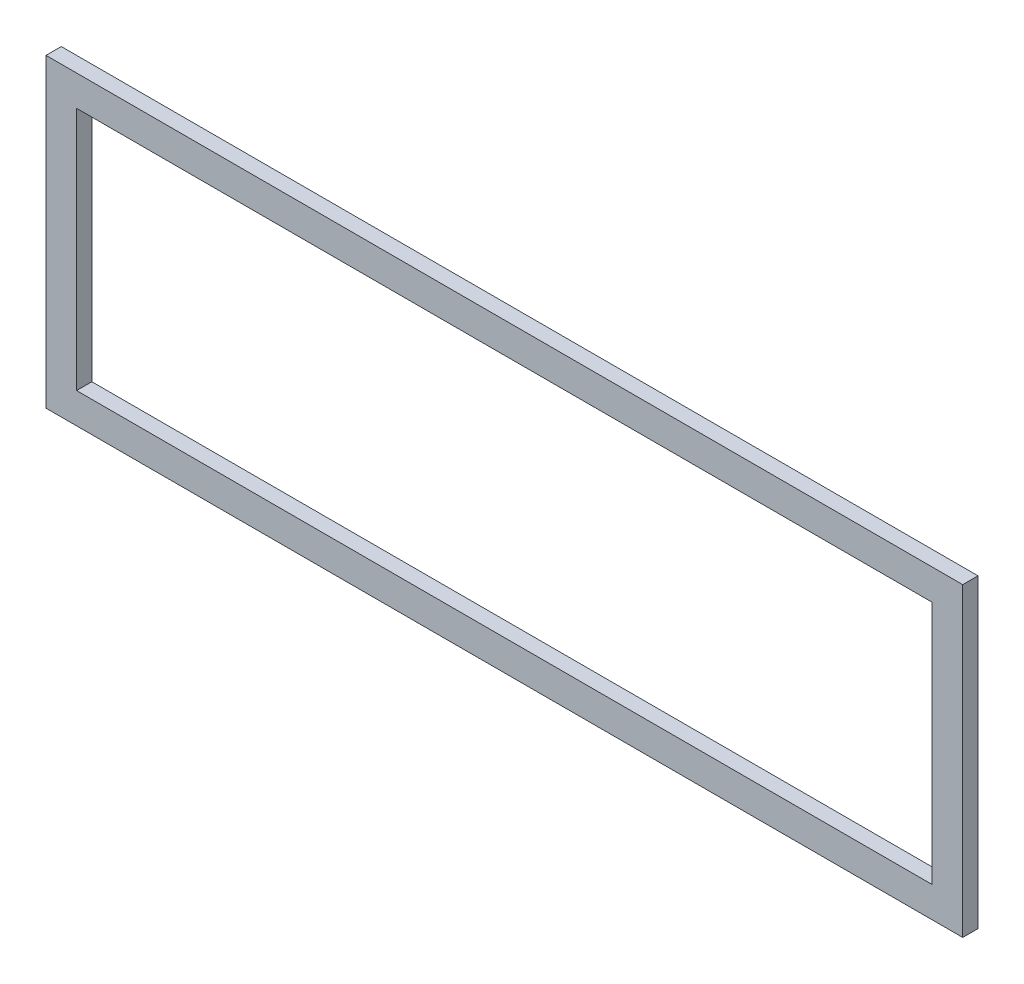
ISO-10303-21;
HEADER;
FILE_DESCRIPTION(('STEP AP214'),'2;1');
FILE_NAME('part.step','',(''),(''),'','','');
FILE_SCHEMA(('AUTOMOTIVE_DESIGN { 1 0 10303 214 1 1 1 1 }'));
ENDSEC;
DATA;
#1=APPLICATION_CONTEXT('core data for automotive mechanical design processes');
#2=APPLICATION_PROTOCOL_DEFINITION('international standard','automotive_design',2000,#1);
#3=PRODUCT_CONTEXT('',#1,'mechanical');
#4=PRODUCT('Part','Part','',(#3));
#5=PRODUCT_RELATED_PRODUCT_CATEGORY('part','',(#4));
#6=PRODUCT_DEFINITION_FORMATION('','',#4);
#7=PRODUCT_DEFINITION_CONTEXT('part definition',#1,'design');
#8=PRODUCT_DEFINITION('design','',#6,#7);
#9=PRODUCT_DEFINITION_SHAPE('','',#8);
#10=(LENGTH_UNIT() NAMED_UNIT(*) SI_UNIT(.MILLI.,.METRE.));
#11=(NAMED_UNIT(*) PLANE_ANGLE_UNIT() SI_UNIT($,.RADIAN.));
#12=(NAMED_UNIT(*) SI_UNIT($,.STERADIAN.) SOLID_ANGLE_UNIT());
#13=UNCERTAINTY_MEASURE_WITH_UNIT(LENGTH_MEASURE(1.E-05),#10,'distance_accuracy_value','');
#14=(GEOMETRIC_REPRESENTATION_CONTEXT(3) GLOBAL_UNCERTAINTY_ASSIGNED_CONTEXT((#13)) GLOBAL_UNIT_ASSIGNED_CONTEXT((#10,
#11,#12)) REPRESENTATION_CONTEXT('',''));
#15=CARTESIAN_POINT('',(0.,0.,0.));
#16=DIRECTION('',(0.,0.,1.));
#17=DIRECTION('',(1.,0.,0.));
#18=AXIS2_PLACEMENT_3D('',#15,#16,#17);
#19=CARTESIAN_POINT('',(0.,0.,2.5));
#20=DIRECTION('',(0.,0.,-1.));
#21=DIRECTION('',(-1.,0.,0.));
#22=AXIS2_PLACEMENT_3D('',#19,#20,#21);
#23=PLANE('',#22);
#24=DIRECTION('',(0.,1.,0.));
#25=VECTOR('',#24,1.);
#26=CARTESIAN_POINT('',(150.,-50.,2.5));
#27=LINE('',#26,#25);
#28=CARTESIAN_POINT('',(150.,-50.,2.5));
#29=VERTEX_POINT('',#28);
#30=CARTESIAN_POINT('',(150.,50.,2.5));
#31=VERTEX_POINT('',#30);
#32=EDGE_CURVE('E134',#29,#31,#27,.T.);
#33=ORIENTED_EDGE('',*,*,#32,.T.);
#34=DIRECTION('',(-1.,0.,0.));
#35=VECTOR('',#34,1.);
#36=CARTESIAN_POINT('',(-150.,50.,2.5));
#37=LINE('',#36,#35);
#38=CARTESIAN_POINT('',(-150.,50.,2.5));
#39=VERTEX_POINT('',#38);
#40=EDGE_CURVE('E137',#31,#39,#37,.T.);
#41=ORIENTED_EDGE('',*,*,#40,.T.);
#42=DIRECTION('',(0.,-1.,0.));
#43=VECTOR('',#42,1.);
#44=CARTESIAN_POINT('',(-150.,-50.,2.5));
#45=LINE('',#44,#43);
#46=CARTESIAN_POINT('',(-150.,-50.,2.5));
#47=VERTEX_POINT('',#46);
#48=EDGE_CURVE('E140',#39,#47,#45,.T.);
#49=ORIENTED_EDGE('',*,*,#48,.T.);
#50=DIRECTION('',(1.,0.,0.));
#51=VECTOR('',#50,1.);
#52=CARTESIAN_POINT('',(-150.,-50.,2.5));
#53=LINE('',#52,#51);
#54=EDGE_CURVE('E142',#47,#29,#53,.T.);
#55=ORIENTED_EDGE('',*,*,#54,.T.);
#56=EDGE_LOOP('',(#33,#41,#49,#55));
#57=FACE_BOUND('',#56,.T.);
#58=DIRECTION('',(0.,1.,0.));
#59=VECTOR('',#58,1.);
#60=CARTESIAN_POINT('',(140.,-40.,2.5));
#61=LINE('',#60,#59);
#62=CARTESIAN_POINT('',(140.,-40.,2.5));
#63=VERTEX_POINT('',#62);
#64=CARTESIAN_POINT('',(140.,40.,2.5));
#65=VERTEX_POINT('',#64);
#66=EDGE_CURVE('E98',#63,#65,#61,.T.);
#67=ORIENTED_EDGE('',*,*,#66,.F.);
#68=DIRECTION('',(1.,0.,0.));
#69=VECTOR('',#68,1.);
#70=CARTESIAN_POINT('',(-140.,-40.,2.5));
#71=LINE('',#70,#69);
#72=CARTESIAN_POINT('',(-140.,-40.,2.5));
#73=VERTEX_POINT('',#72);
#74=EDGE_CURVE('E120',#73,#63,#71,.T.);
#75=ORIENTED_EDGE('',*,*,#74,.F.);
#76=DIRECTION('',(0.,-1.,0.));
#77=VECTOR('',#76,1.);
#78=CARTESIAN_POINT('',(-140.,-40.,2.5));
#79=LINE('',#78,#77);
#80=CARTESIAN_POINT('',(-140.,40.,2.5));
#81=VERTEX_POINT('',#80);
#82=EDGE_CURVE('E118',#81,#73,#79,.T.);
#83=ORIENTED_EDGE('',*,*,#82,.F.);
#84=DIRECTION('',(-1.,0.,0.));
#85=VECTOR('',#84,1.);
#86=CARTESIAN_POINT('',(-140.,40.,2.5));
#87=LINE('',#86,#85);
#88=EDGE_CURVE('E106',#65,#81,#87,.T.);
#89=ORIENTED_EDGE('',*,*,#88,.F.);
#90=EDGE_LOOP('',(#67,#75,#83,#89));
#91=FACE_BOUND('',#90,.T.);
#92=ADVANCED_FACE('F33',(#57,#91),#23,.F.);
#93=CARTESIAN_POINT('',(0.,0.,-2.5));
#94=DIRECTION('',(0.,0.,-1.));
#95=DIRECTION('',(-1.,0.,0.));
#96=AXIS2_PLACEMENT_3D('',#93,#94,#95);
#97=PLANE('',#96);
#98=DIRECTION('',(0.,1.,0.));
#99=VECTOR('',#98,1.);
#100=CARTESIAN_POINT('',(150.,-50.,-2.5));
#101=LINE('',#100,#99);
#102=CARTESIAN_POINT('',(150.,-50.,-2.5));
#103=VERTEX_POINT('',#102);
#104=CARTESIAN_POINT('',(150.,50.,-2.5));
#105=VERTEX_POINT('',#104);
#106=EDGE_CURVE('E114',#103,#105,#101,.T.);
#107=ORIENTED_EDGE('',*,*,#106,.F.);
#108=DIRECTION('',(1.,0.,0.));
#109=VECTOR('',#108,1.);
#110=CARTESIAN_POINT('',(-150.,-50.,-2.5));
#111=LINE('',#110,#109);
#112=CARTESIAN_POINT('',(-150.,-50.,-2.5));
#113=VERTEX_POINT('',#112);
#114=EDGE_CURVE('E138',#113,#103,#111,.T.);
#115=ORIENTED_EDGE('',*,*,#114,.F.);
#116=DIRECTION('',(0.,-1.,0.));
#117=VECTOR('',#116,1.);
#118=CARTESIAN_POINT('',(-150.,-50.,-2.5));
#119=LINE('',#118,#117);
#120=CARTESIAN_POINT('',(-150.,50.,-2.5));
#121=VERTEX_POINT('',#120);
#122=EDGE_CURVE('E149',#121,#113,#119,.T.);
#123=ORIENTED_EDGE('',*,*,#122,.F.);
#124=DIRECTION('',(-1.,0.,0.));
#125=VECTOR('',#124,1.);
#126=CARTESIAN_POINT('',(-150.,50.,-2.5));
#127=LINE('',#126,#125);
#128=EDGE_CURVE('E147',#105,#121,#127,.T.);
#129=ORIENTED_EDGE('',*,*,#128,.F.);
#130=EDGE_LOOP('',(#107,#115,#123,#129));
#131=FACE_BOUND('',#130,.T.);
#132=DIRECTION('',(1.,0.,0.));
#133=VECTOR('',#132,1.);
#134=CARTESIAN_POINT('',(-140.,-40.,-2.5));
#135=LINE('',#134,#133);
#136=CARTESIAN_POINT('',(-140.,-40.,-2.5));
#137=VERTEX_POINT('',#136);
#138=CARTESIAN_POINT('',(140.,-40.,-2.5));
#139=VERTEX_POINT('',#138);
#140=EDGE_CURVE('E107',#137,#139,#135,.T.);
#141=ORIENTED_EDGE('',*,*,#140,.T.);
#142=DIRECTION('',(0.,1.,0.));
#143=VECTOR('',#142,1.);
#144=CARTESIAN_POINT('',(140.,-40.,-2.5));
#145=LINE('',#144,#143);
#146=CARTESIAN_POINT('',(140.,40.,-2.5));
#147=VERTEX_POINT('',#146);
#148=EDGE_CURVE('E56',#139,#147,#145,.T.);
#149=ORIENTED_EDGE('',*,*,#148,.T.);
#150=DIRECTION('',(-1.,0.,0.));
#151=VECTOR('',#150,1.);
#152=CARTESIAN_POINT('',(-140.,40.,-2.5));
#153=LINE('',#152,#151);
#154=CARTESIAN_POINT('',(-140.,40.,-2.5));
#155=VERTEX_POINT('',#154);
#156=EDGE_CURVE('E113',#147,#155,#153,.T.);
#157=ORIENTED_EDGE('',*,*,#156,.T.);
#158=DIRECTION('',(0.,-1.,0.));
#159=VECTOR('',#158,1.);
#160=CARTESIAN_POINT('',(-140.,-40.,-2.5));
#161=LINE('',#160,#159);
#162=EDGE_CURVE('E126',#155,#137,#161,.T.);
#163=ORIENTED_EDGE('',*,*,#162,.T.);
#164=EDGE_LOOP('',(#141,#149,#157,#163));
#165=FACE_BOUND('',#164,.T.);
#166=ADVANCED_FACE('F167',(#131,#165),#97,.T.);
#167=CARTESIAN_POINT('',(150.,-50.,2.5));
#168=DIRECTION('',(-1.,0.,0.));
#169=DIRECTION('',(0.,0.,1.));
#170=AXIS2_PLACEMENT_3D('',#167,#168,#169);
#171=PLANE('',#170);
#172=ORIENTED_EDGE('',*,*,#106,.T.);
#173=DIRECTION('',(0.,0.,-1.));
#174=VECTOR('',#173,1.);
#175=CARTESIAN_POINT('',(150.,50.,2.5));
#176=LINE('',#175,#174);
#177=EDGE_CURVE('E11',#31,#105,#176,.T.);
#178=ORIENTED_EDGE('',*,*,#177,.F.);
#179=ORIENTED_EDGE('',*,*,#32,.F.);
#180=DIRECTION('',(0.,0.,-1.));
#181=VECTOR('',#180,1.);
#182=CARTESIAN_POINT('',(150.,-50.,2.5));
#183=LINE('',#182,#181);
#184=EDGE_CURVE('E144',#29,#103,#183,.T.);
#185=ORIENTED_EDGE('',*,*,#184,.T.);
#186=EDGE_LOOP('',(#172,#178,#179,#185));
#187=FACE_BOUND('',#186,.T.);
#188=ADVANCED_FACE('F35',(#187),#171,.F.);
#189=CARTESIAN_POINT('',(-150.,50.,2.5));
#190=DIRECTION('',(0.,-1.,0.));
#191=DIRECTION('',(1.,0.,0.));
#192=AXIS2_PLACEMENT_3D('',#189,#190,#191);
#193=PLANE('',#192);
#194=ORIENTED_EDGE('',*,*,#128,.T.);
#195=DIRECTION('',(0.,0.,-1.));
#196=VECTOR('',#195,1.);
#197=CARTESIAN_POINT('',(-150.,50.,2.5));
#198=LINE('',#197,#196);
#199=EDGE_CURVE('E41',#39,#121,#198,.T.);
#200=ORIENTED_EDGE('',*,*,#199,.F.);
#201=ORIENTED_EDGE('',*,*,#40,.F.);
#202=ORIENTED_EDGE('',*,*,#177,.T.);
#203=EDGE_LOOP('',(#194,#200,#201,#202));
#204=FACE_BOUND('',#203,.T.);
#205=ADVANCED_FACE('F177',(#204),#193,.F.);
#206=CARTESIAN_POINT('',(-150.,-50.,2.5));
#207=DIRECTION('',(1.,0.,0.));
#208=DIRECTION('',(0.,0.,-1.));
#209=AXIS2_PLACEMENT_3D('',#206,#207,#208);
#210=PLANE('',#209);
#211=ORIENTED_EDGE('',*,*,#122,.T.);
#212=DIRECTION('',(0.,0.,-1.));
#213=VECTOR('',#212,1.);
#214=CARTESIAN_POINT('',(-150.,-50.,2.5));
#215=LINE('',#214,#213);
#216=EDGE_CURVE('E154',#47,#113,#215,.T.);
#217=ORIENTED_EDGE('',*,*,#216,.F.);
#218=ORIENTED_EDGE('',*,*,#48,.F.);
#219=ORIENTED_EDGE('',*,*,#199,.T.);
#220=EDGE_LOOP('',(#211,#217,#218,#219));
#221=FACE_BOUND('',#220,.T.);
#222=ADVANCED_FACE('F161',(#221),#210,.F.);
#223=CARTESIAN_POINT('',(-150.,-50.,2.5));
#224=DIRECTION('',(0.,1.,0.));
#225=DIRECTION('',(0.,0.,1.));
#226=AXIS2_PLACEMENT_3D('',#223,#224,#225);
#227=PLANE('',#226);
#228=ORIENTED_EDGE('',*,*,#114,.T.);
#229=ORIENTED_EDGE('',*,*,#184,.F.);
#230=ORIENTED_EDGE('',*,*,#54,.F.);
#231=ORIENTED_EDGE('',*,*,#216,.T.);
#232=EDGE_LOOP('',(#228,#229,#230,#231));
#233=FACE_BOUND('',#232,.T.);
#234=ADVANCED_FACE('F171',(#233),#227,.F.);
#235=CARTESIAN_POINT('',(140.,-40.,2.5));
#236=DIRECTION('',(-1.,0.,0.));
#237=DIRECTION('',(0.,0.,1.));
#238=AXIS2_PLACEMENT_3D('',#235,#236,#237);
#239=PLANE('',#238);
#240=ORIENTED_EDGE('',*,*,#148,.F.);
#241=DIRECTION('',(0.,0.,-1.));
#242=VECTOR('',#241,1.);
#243=CARTESIAN_POINT('',(140.,-40.,2.5));
#244=LINE('',#243,#242);
#245=EDGE_CURVE('E102',#63,#139,#244,.T.);
#246=ORIENTED_EDGE('',*,*,#245,.F.);
#247=ORIENTED_EDGE('',*,*,#66,.T.);
#248=DIRECTION('',(0.,0.,-1.));
#249=VECTOR('',#248,1.);
#250=CARTESIAN_POINT('',(140.,40.,2.5));
#251=LINE('',#250,#249);
#252=EDGE_CURVE('E101',#65,#147,#251,.T.);
#253=ORIENTED_EDGE('',*,*,#252,.T.);
#254=EDGE_LOOP('',(#240,#246,#247,#253));
#255=FACE_BOUND('',#254,.T.);
#256=ADVANCED_FACE('F100',(#255),#239,.T.);
#257=CARTESIAN_POINT('',(-140.,40.,2.5));
#258=DIRECTION('',(0.,-1.,0.));
#259=DIRECTION('',(0.,0.,-1.));
#260=AXIS2_PLACEMENT_3D('',#257,#258,#259);
#261=PLANE('',#260);
#262=ORIENTED_EDGE('',*,*,#156,.F.);
#263=ORIENTED_EDGE('',*,*,#252,.F.);
#264=ORIENTED_EDGE('',*,*,#88,.T.);
#265=DIRECTION('',(0.,0.,-1.));
#266=VECTOR('',#265,1.);
#267=CARTESIAN_POINT('',(-140.,40.,2.5));
#268=LINE('',#267,#266);
#269=EDGE_CURVE('E115',#81,#155,#268,.T.);
#270=ORIENTED_EDGE('',*,*,#269,.T.);
#271=EDGE_LOOP('',(#262,#263,#264,#270));
#272=FACE_BOUND('',#271,.T.);
#273=ADVANCED_FACE('F110',(#272),#261,.T.);
#274=CARTESIAN_POINT('',(-140.,-40.,2.5));
#275=DIRECTION('',(1.,0.,0.));
#276=DIRECTION('',(0.,0.,-1.));
#277=AXIS2_PLACEMENT_3D('',#274,#275,#276);
#278=PLANE('',#277);
#279=ORIENTED_EDGE('',*,*,#162,.F.);
#280=ORIENTED_EDGE('',*,*,#269,.F.);
#281=ORIENTED_EDGE('',*,*,#82,.T.);
#282=DIRECTION('',(0.,0.,-1.));
#283=VECTOR('',#282,1.);
#284=CARTESIAN_POINT('',(-140.,-40.,2.5));
#285=LINE('',#284,#283);
#286=EDGE_CURVE('E48',#73,#137,#285,.T.);
#287=ORIENTED_EDGE('',*,*,#286,.T.);
#288=EDGE_LOOP('',(#279,#280,#281,#287));
#289=FACE_BOUND('',#288,.T.);
#290=ADVANCED_FACE('F200',(#289),#278,.T.);
#291=CARTESIAN_POINT('',(-140.,-40.,2.5));
#292=DIRECTION('',(0.,1.,0.));
#293=DIRECTION('',(0.,0.,1.));
#294=AXIS2_PLACEMENT_3D('',#291,#292,#293);
#295=PLANE('',#294);
#296=ORIENTED_EDGE('',*,*,#140,.F.);
#297=ORIENTED_EDGE('',*,*,#286,.F.);
#298=ORIENTED_EDGE('',*,*,#74,.T.);
#299=ORIENTED_EDGE('',*,*,#245,.T.);
#300=EDGE_LOOP('',(#296,#297,#298,#299));
#301=FACE_BOUND('',#300,.T.);
#302=ADVANCED_FACE('F204',(#301),#295,.T.);
#303=CLOSED_SHELL('',(#92,#166,#188,#205,#222,#234,#256,#273,#290,#302));
#304=MANIFOLD_SOLID_BREP('B2',#303);
#305=ADVANCED_BREP_SHAPE_REPRESENTATION('',(#18,#304),#14);
#306=SHAPE_DEFINITION_REPRESENTATION(#9,#305);
ENDSEC;
END-ISO-10303-21;
